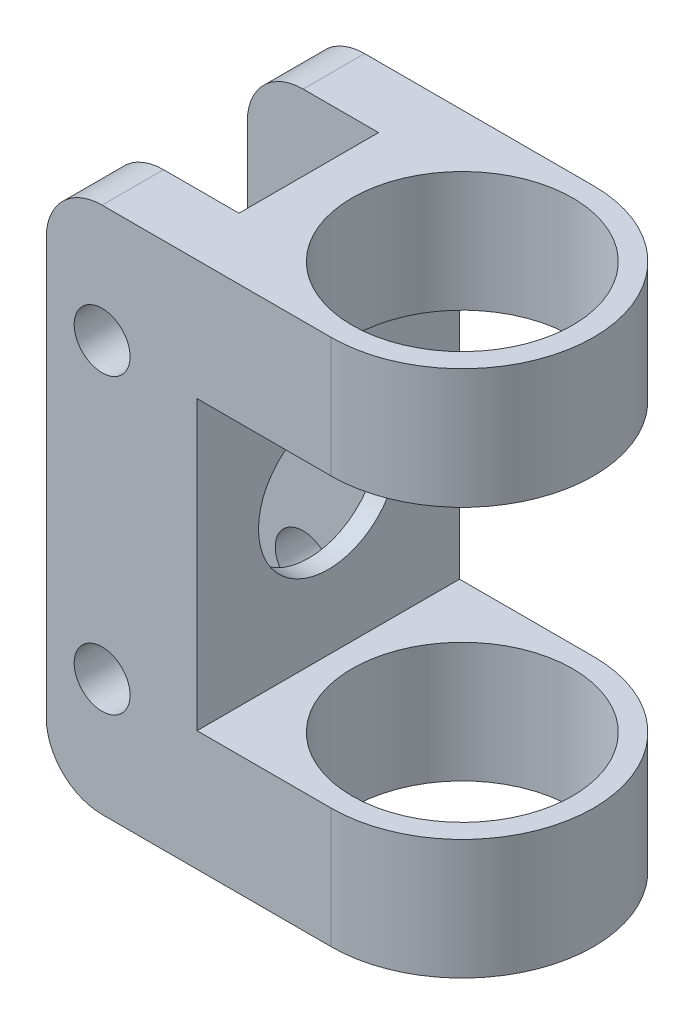
ISO-10303-21;
HEADER;
FILE_DESCRIPTION(('STEP AP214'),'2;1');
FILE_NAME('part.step','',(''),(''),'','','');
FILE_SCHEMA(('AUTOMOTIVE_DESIGN { 1 0 10303 214 1 1 1 1 }'));
ENDSEC;
DATA;
#1=APPLICATION_CONTEXT('core data for automotive mechanical design processes');
#2=APPLICATION_PROTOCOL_DEFINITION('international standard','automotive_design',2000,#1);
#3=PRODUCT_CONTEXT('',#1,'mechanical');
#4=PRODUCT('Part','Part','',(#3));
#5=PRODUCT_RELATED_PRODUCT_CATEGORY('part','',(#4));
#6=PRODUCT_DEFINITION_FORMATION('','',#4);
#7=PRODUCT_DEFINITION_CONTEXT('part definition',#1,'design');
#8=PRODUCT_DEFINITION('design','',#6,#7);
#9=PRODUCT_DEFINITION_SHAPE('','',#8);
#10=(LENGTH_UNIT() NAMED_UNIT(*) SI_UNIT(.MILLI.,.METRE.));
#11=(NAMED_UNIT(*) PLANE_ANGLE_UNIT() SI_UNIT($,.RADIAN.));
#12=(NAMED_UNIT(*) SI_UNIT($,.STERADIAN.) SOLID_ANGLE_UNIT());
#13=UNCERTAINTY_MEASURE_WITH_UNIT(LENGTH_MEASURE(1.E-05),#10,'distance_accuracy_value','');
#14=(GEOMETRIC_REPRESENTATION_CONTEXT(3) GLOBAL_UNCERTAINTY_ASSIGNED_CONTEXT((#13)) GLOBAL_UNIT_ASSIGNED_CONTEXT((#10,
#11,#12)) REPRESENTATION_CONTEXT('',''));
#15=CARTESIAN_POINT('',(0.,0.,0.));
#16=DIRECTION('',(0.,0.,1.));
#17=DIRECTION('',(1.,0.,0.));
#18=AXIS2_PLACEMENT_3D('',#15,#16,#17);
#19=CARTESIAN_POINT('',(-13.97,24.003,-6.35));
#20=DIRECTION('',(1.,0.,0.));
#21=DIRECTION('',(0.,0.,-1.));
#22=AXIS2_PLACEMENT_3D('',#19,#20,#21);
#23=PLANE('',#22);
#24=DIRECTION('',(0.,-1.,0.));
#25=VECTOR('',#24,1.);
#26=CARTESIAN_POINT('',(-13.97,24.003,-6.35));
#27=LINE('',#26,#25);
#28=CARTESIAN_POINT('',(-13.97,24.003,-6.35));
#29=VERTEX_POINT('',#28);
#30=CARTESIAN_POINT('',(-13.97,0.,-6.35));
#31=VERTEX_POINT('',#30);
#32=EDGE_CURVE('E174',#29,#31,#27,.T.);
#33=ORIENTED_EDGE('',*,*,#32,.T.);
#34=CARTESIAN_POINT('',(-13.97,0.,0.));
#35=DIRECTION('',(1.,0.,0.));
#36=DIRECTION('',(0.,0.,-1.));
#37=AXIS2_PLACEMENT_3D('',#34,#35,#36);
#38=CIRCLE('',#37,6.35);
#39=CARTESIAN_POINT('',(-13.97,0.,6.35));
#40=VERTEX_POINT('',#39);
#41=EDGE_CURVE('E158',#31,#40,#38,.T.);
#42=ORIENTED_EDGE('',*,*,#41,.T.);
#43=DIRECTION('',(0.,-1.,0.));
#44=VECTOR('',#43,1.);
#45=CARTESIAN_POINT('',(-13.97,24.003,6.35));
#46=LINE('',#45,#44);
#47=CARTESIAN_POINT('',(-13.97,24.003,6.35));
#48=VERTEX_POINT('',#47);
#49=EDGE_CURVE('E171',#48,#40,#46,.T.);
#50=ORIENTED_EDGE('',*,*,#49,.F.);
#51=DIRECTION('',(0.,0.,1.));
#52=VECTOR('',#51,1.);
#53=CARTESIAN_POINT('',(-13.97,24.003,-6.35));
#54=LINE('',#53,#52);
#55=EDGE_CURVE('E280',#29,#48,#54,.T.);
#56=ORIENTED_EDGE('',*,*,#55,.F.);
#57=EDGE_LOOP('',(#33,#42,#50,#56));
#58=FACE_BOUND('',#57,.T.);
#59=ADVANCED_FACE('F36',(#58),#23,.F.);
#60=CARTESIAN_POINT('',(0.,24.003,0.));
#61=DIRECTION('',(0.,-1.,0.));
#62=DIRECTION('',(0.,0.,-1.));
#63=AXIS2_PLACEMENT_3D('',#60,#61,#62);
#64=CYLINDRICAL_SURFACE('',#63,11.938);
#65=DIRECTION('',(0.,-1.,0.));
#66=VECTOR('',#65,1.);
#67=CARTESIAN_POINT('',(0.,24.003,-11.938));
#68=LINE('',#67,#66);
#69=CARTESIAN_POINT('',(0.,-13.081,-11.938));
#70=VERTEX_POINT('',#69);
#71=CARTESIAN_POINT('',(0.,-24.003,-11.938));
#72=VERTEX_POINT('',#71);
#73=EDGE_CURVE('E207',#70,#72,#68,.T.);
#74=ORIENTED_EDGE('',*,*,#73,.F.);
#75=CARTESIAN_POINT('',(0.,-13.081,0.));
#76=DIRECTION('',(0.,-1.,0.));
#77=DIRECTION('',(0.,0.,-1.));
#78=AXIS2_PLACEMENT_3D('',#75,#76,#77);
#79=CIRCLE('',#78,11.938);
#80=CARTESIAN_POINT('',(0.,-13.081,11.938));
#81=VERTEX_POINT('',#80);
#82=EDGE_CURVE('E223',#70,#81,#79,.T.);
#83=ORIENTED_EDGE('',*,*,#82,.T.);
#84=DIRECTION('',(0.,-1.,0.));
#85=VECTOR('',#84,1.);
#86=CARTESIAN_POINT('',(0.,24.003,11.938));
#87=LINE('',#86,#85);
#88=CARTESIAN_POINT('',(0.,-24.003,11.938));
#89=VERTEX_POINT('',#88);
#90=EDGE_CURVE('E297',#81,#89,#87,.T.);
#91=ORIENTED_EDGE('',*,*,#90,.T.);
#92=CARTESIAN_POINT('',(0.,-24.003,0.));
#93=DIRECTION('',(0.,1.,0.));
#94=DIRECTION('',(0.,0.,1.));
#95=AXIS2_PLACEMENT_3D('',#92,#93,#94);
#96=CIRCLE('',#95,11.938);
#97=EDGE_CURVE('E316',#89,#72,#96,.T.);
#98=ORIENTED_EDGE('',*,*,#97,.T.);
#99=EDGE_LOOP('',(#74,#83,#91,#98));
#100=FACE_BOUND('',#99,.T.);
#101=ADVANCED_FACE('F455',(#100),#64,.T.);
#102=CARTESIAN_POINT('',(0.,24.003,0.));
#103=DIRECTION('',(0.,-1.,0.));
#104=DIRECTION('',(0.,0.,-1.));
#105=AXIS2_PLACEMENT_3D('',#102,#103,#104);
#106=CYLINDRICAL_SURFACE('',#105,10.033);
#107=CARTESIAN_POINT('',(0.,-13.081,0.));
#108=DIRECTION('',(0.,-1.,0.));
#109=DIRECTION('',(0.,0.,-1.));
#110=AXIS2_PLACEMENT_3D('',#107,#108,#109);
#111=CIRCLE('',#110,10.033);
#112=CARTESIAN_POINT('',(0.,-13.081,-10.033));
#113=VERTEX_POINT('',#112);
#114=EDGE_CURVE('E219',#113,#113,#111,.T.);
#115=ORIENTED_EDGE('',*,*,#114,.F.);
#116=EDGE_LOOP('',(#115));
#117=FACE_BOUND('',#116,.T.);
#118=CARTESIAN_POINT('',(0.,-24.003,0.));
#119=DIRECTION('',(0.,1.,0.));
#120=DIRECTION('',(0.,0.,1.));
#121=AXIS2_PLACEMENT_3D('',#118,#119,#120);
#122=CIRCLE('',#121,10.033);
#123=CARTESIAN_POINT('',(0.,-24.003,10.033));
#124=VERTEX_POINT('',#123);
#125=EDGE_CURVE('E334',#124,#124,#122,.T.);
#126=ORIENTED_EDGE('',*,*,#125,.F.);
#127=EDGE_LOOP('',(#126));
#128=FACE_BOUND('',#127,.T.);
#129=ADVANCED_FACE('F510',(#117,#128),#106,.F.);
#130=CARTESIAN_POINT('',(0.,24.003,0.));
#131=DIRECTION('',(0.,1.,0.));
#132=DIRECTION('',(0.,0.,1.));
#133=AXIS2_PLACEMENT_3D('',#130,#131,#132);
#134=PLANE('',#133);
#135=DIRECTION('',(-1.,0.,0.));
#136=VECTOR('',#135,1.);
#137=CARTESIAN_POINT('',(0.,24.003,-11.938));
#138=LINE('',#137,#136);
#139=CARTESIAN_POINT('',(0.,24.003,-11.938));
#140=VERTEX_POINT('',#139);
#141=CARTESIAN_POINT('',(-20.828,24.003,-11.938));
#142=VERTEX_POINT('',#141);
#143=EDGE_CURVE('E328',#140,#142,#138,.T.);
#144=ORIENTED_EDGE('',*,*,#143,.T.);
#145=DIRECTION('',(0.,0.,1.));
#146=VECTOR('',#145,1.);
#147=CARTESIAN_POINT('',(-20.828,24.003,-6.35));
#148=LINE('',#147,#146);
#149=CARTESIAN_POINT('',(-20.828,24.003,-6.35));
#150=VERTEX_POINT('',#149);
#151=EDGE_CURVE('E230',#142,#150,#148,.T.);
#152=ORIENTED_EDGE('',*,*,#151,.T.);
#153=DIRECTION('',(1.,0.,0.));
#154=VECTOR('',#153,1.);
#155=CARTESIAN_POINT('',(-25.908,24.003,-6.35));
#156=LINE('',#155,#154);
#157=EDGE_CURVE('E325',#150,#29,#156,.T.);
#158=ORIENTED_EDGE('',*,*,#157,.T.);
#159=ORIENTED_EDGE('',*,*,#55,.T.);
#160=DIRECTION('',(-1.,0.,0.));
#161=VECTOR('',#160,1.);
#162=CARTESIAN_POINT('',(-13.97,24.003,6.35));
#163=LINE('',#162,#161);
#164=CARTESIAN_POINT('',(-20.828,24.003,6.35));
#165=VERTEX_POINT('',#164);
#166=EDGE_CURVE('E189',#48,#165,#163,.T.);
#167=ORIENTED_EDGE('',*,*,#166,.T.);
#168=DIRECTION('',(0.,0.,1.));
#169=VECTOR('',#168,1.);
#170=CARTESIAN_POINT('',(-20.828,24.003,11.938));
#171=LINE('',#170,#169);
#172=CARTESIAN_POINT('',(-20.828,24.003,11.938));
#173=VERTEX_POINT('',#172);
#174=EDGE_CURVE('E212',#165,#173,#171,.T.);
#175=ORIENTED_EDGE('',*,*,#174,.T.);
#176=DIRECTION('',(1.,0.,0.));
#177=VECTOR('',#176,1.);
#178=CARTESIAN_POINT('',(-25.908,24.003,11.938));
#179=LINE('',#178,#177);
#180=CARTESIAN_POINT('',(0.,24.003,11.938));
#181=VERTEX_POINT('',#180);
#182=EDGE_CURVE('E282',#173,#181,#179,.T.);
#183=ORIENTED_EDGE('',*,*,#182,.T.);
#184=CARTESIAN_POINT('',(0.,24.003,0.));
#185=DIRECTION('',(0.,1.,0.));
#186=DIRECTION('',(0.,0.,1.));
#187=AXIS2_PLACEMENT_3D('',#184,#185,#186);
#188=CIRCLE('',#187,11.938);
#189=EDGE_CURVE('E303',#181,#140,#188,.T.);
#190=ORIENTED_EDGE('',*,*,#189,.T.);
#191=EDGE_LOOP('',(#144,#152,#158,#159,#167,#175,#183,#190));
#192=FACE_BOUND('',#191,.T.);
#193=CARTESIAN_POINT('',(0.,24.003,0.));
#194=DIRECTION('',(0.,1.,0.));
#195=DIRECTION('',(0.,0.,1.));
#196=AXIS2_PLACEMENT_3D('',#193,#194,#195);
#197=CIRCLE('',#196,10.033);
#198=CARTESIAN_POINT('',(0.,24.003,10.033));
#199=VERTEX_POINT('',#198);
#200=EDGE_CURVE('E320',#199,#199,#197,.T.);
#201=ORIENTED_EDGE('',*,*,#200,.F.);
#202=EDGE_LOOP('',(#201));
#203=FACE_BOUND('',#202,.T.);
#204=ADVANCED_FACE('F277',(#192,#203),#134,.T.);
#205=CARTESIAN_POINT('',(0.,-24.003,0.));
#206=DIRECTION('',(0.,1.,0.));
#207=DIRECTION('',(0.,0.,1.));
#208=AXIS2_PLACEMENT_3D('',#205,#206,#207);
#209=PLANE('',#208);
#210=DIRECTION('',(1.,0.,0.));
#211=VECTOR('',#210,1.);
#212=CARTESIAN_POINT('',(-25.908,-24.003,-6.35));
#213=LINE('',#212,#211);
#214=CARTESIAN_POINT('',(-20.828,-24.003,-6.35));
#215=VERTEX_POINT('',#214);
#216=CARTESIAN_POINT('',(-13.97,-24.003,-6.35));
#217=VERTEX_POINT('',#216);
#218=EDGE_CURVE('E309',#215,#217,#213,.T.);
#219=ORIENTED_EDGE('',*,*,#218,.F.);
#220=DIRECTION('',(0.,0.,1.));
#221=VECTOR('',#220,1.);
#222=CARTESIAN_POINT('',(-20.828,-24.003,0.));
#223=LINE('',#222,#221);
#224=CARTESIAN_POINT('',(-20.828,-24.003,-11.938));
#225=VERTEX_POINT('',#224);
#226=EDGE_CURVE('E256',#215,#225,#223,.F.);
#227=ORIENTED_EDGE('',*,*,#226,.T.);
#228=DIRECTION('',(-1.,0.,0.));
#229=VECTOR('',#228,1.);
#230=CARTESIAN_POINT('',(0.,-24.003,-11.938));
#231=LINE('',#230,#229);
#232=EDGE_CURVE('E312',#72,#225,#231,.T.);
#233=ORIENTED_EDGE('',*,*,#232,.F.);
#234=ORIENTED_EDGE('',*,*,#97,.F.);
#235=DIRECTION('',(1.,0.,0.));
#236=VECTOR('',#235,1.);
#237=CARTESIAN_POINT('',(-25.908,-24.003,11.938));
#238=LINE('',#237,#236);
#239=CARTESIAN_POINT('',(-20.828,-24.003,11.938));
#240=VERTEX_POINT('',#239);
#241=EDGE_CURVE('E300',#240,#89,#238,.T.);
#242=ORIENTED_EDGE('',*,*,#241,.F.);
#243=DIRECTION('',(0.,0.,1.));
#244=VECTOR('',#243,1.);
#245=CARTESIAN_POINT('',(-20.828,-24.003,0.));
#246=LINE('',#245,#244);
#247=CARTESIAN_POINT('',(-20.828,-24.003,6.35));
#248=VERTEX_POINT('',#247);
#249=EDGE_CURVE('E253',#240,#248,#246,.F.);
#250=ORIENTED_EDGE('',*,*,#249,.T.);
#251=DIRECTION('',(-1.,0.,0.));
#252=VECTOR('',#251,1.);
#253=CARTESIAN_POINT('',(-13.97,-24.003,6.35));
#254=LINE('',#253,#252);
#255=CARTESIAN_POINT('',(-13.97,-24.003,6.35));
#256=VERTEX_POINT('',#255);
#257=EDGE_CURVE('E304',#256,#248,#254,.T.);
#258=ORIENTED_EDGE('',*,*,#257,.F.);
#259=DIRECTION('',(0.,0.,1.));
#260=VECTOR('',#259,1.);
#261=CARTESIAN_POINT('',(-13.97,-24.003,-6.35));
#262=LINE('',#261,#260);
#263=EDGE_CURVE('E181',#217,#256,#262,.T.);
#264=ORIENTED_EDGE('',*,*,#263,.F.);
#265=EDGE_LOOP('',(#219,#227,#233,#234,#242,#250,#258,#264));
#266=FACE_BOUND('',#265,.T.);
#267=ORIENTED_EDGE('',*,*,#125,.T.);
#268=EDGE_LOOP('',(#267));
#269=FACE_BOUND('',#268,.T.);
#270=ADVANCED_FACE('F446',(#266,#269),#209,.F.);
#271=CARTESIAN_POINT('',(0.,13.081,11.938));
#272=VERTEX_POINT('',#271);
#273=EDGE_CURVE('E292',#181,#272,#87,.T.);
#274=ORIENTED_EDGE('',*,*,#273,.T.);
#275=CARTESIAN_POINT('',(0.,13.081,0.));
#276=DIRECTION('',(0.,1.,0.));
#277=DIRECTION('',(-1.,0.,0.));
#278=AXIS2_PLACEMENT_3D('',#275,#276,#277);
#279=CIRCLE('',#278,11.938);
#280=CARTESIAN_POINT('',(0.,13.081,-11.938));
#281=VERTEX_POINT('',#280);
#282=EDGE_CURVE('E217',#272,#281,#279,.T.);
#283=ORIENTED_EDGE('',*,*,#282,.T.);
#284=EDGE_CURVE('E208',#140,#281,#68,.T.);
#285=ORIENTED_EDGE('',*,*,#284,.F.);
#286=ORIENTED_EDGE('',*,*,#189,.F.);
#287=EDGE_LOOP('',(#274,#283,#285,#286));
#288=FACE_BOUND('',#287,.T.);
#289=ADVANCED_FACE('F426',(#288),#64,.T.);
#290=CARTESIAN_POINT('',(0.,24.003,-11.938));
#291=DIRECTION('',(0.,0.,1.));
#292=DIRECTION('',(1.,0.,0.));
#293=AXIS2_PLACEMENT_3D('',#290,#291,#292);
#294=PLANE('',#293);
#295=CARTESIAN_POINT('',(-20.828,13.335,-11.938));
#296=DIRECTION('',(0.,0.,1.));
#297=DIRECTION('',(1.,0.,0.));
#298=AXIS2_PLACEMENT_3D('',#295,#296,#297);
#299=CIRCLE('',#298,2.54);
#300=CARTESIAN_POINT('',(-18.288,13.335,-11.938));
#301=VERTEX_POINT('',#300);
#302=EDGE_CURVE('E369',#301,#301,#299,.T.);
#303=ORIENTED_EDGE('',*,*,#302,.T.);
#304=EDGE_LOOP('',(#303));
#305=FACE_BOUND('',#304,.T.);
#306=CARTESIAN_POINT('',(-20.828,-13.335,-11.938));
#307=DIRECTION('',(0.,0.,1.));
#308=DIRECTION('',(1.,0.,0.));
#309=AXIS2_PLACEMENT_3D('',#306,#307,#308);
#310=CIRCLE('',#309,2.54);
#311=CARTESIAN_POINT('',(-18.288,-13.335,-11.938));
#312=VERTEX_POINT('',#311);
#313=EDGE_CURVE('E361',#312,#312,#310,.T.);
#314=ORIENTED_EDGE('',*,*,#313,.T.);
#315=EDGE_LOOP('',(#314));
#316=FACE_BOUND('',#315,.T.);
#317=DIRECTION('',(0.,-1.,0.));
#318=VECTOR('',#317,1.);
#319=CARTESIAN_POINT('',(-25.908,24.003,-11.938));
#320=LINE('',#319,#318);
#321=CARTESIAN_POINT('',(-25.908,18.923,-11.938));
#322=VERTEX_POINT('',#321);
#323=CARTESIAN_POINT('',(-25.908,-18.923,-11.938));
#324=VERTEX_POINT('',#323);
#325=EDGE_CURVE('E203',#322,#324,#320,.T.);
#326=ORIENTED_EDGE('',*,*,#325,.F.);
#327=CARTESIAN_POINT('',(-20.828,18.923,-11.938));
#328=DIRECTION('',(0.,0.,1.));
#329=DIRECTION('',(1.,0.,0.));
#330=AXIS2_PLACEMENT_3D('',#327,#328,#329);
#331=CIRCLE('',#330,5.08);
#332=EDGE_CURVE('E250',#322,#142,#331,.F.);
#333=ORIENTED_EDGE('',*,*,#332,.T.);
#334=ORIENTED_EDGE('',*,*,#143,.F.);
#335=ORIENTED_EDGE('',*,*,#284,.T.);
#336=DIRECTION('',(-1.,0.,0.));
#337=VECTOR('',#336,1.);
#338=CARTESIAN_POINT('',(-12.192,13.081,-11.938));
#339=LINE('',#338,#337);
#340=CARTESIAN_POINT('',(-12.192,13.081,-11.938));
#341=VERTEX_POINT('',#340);
#342=EDGE_CURVE('E391',#281,#341,#339,.T.);
#343=ORIENTED_EDGE('',*,*,#342,.T.);
#344=DIRECTION('',(0.,-1.,0.));
#345=VECTOR('',#344,1.);
#346=CARTESIAN_POINT('',(-12.192,-13.081,-11.938));
#347=LINE('',#346,#345);
#348=CARTESIAN_POINT('',(-12.192,-13.081,-11.938));
#349=VERTEX_POINT('',#348);
#350=EDGE_CURVE('E387',#341,#349,#347,.T.);
#351=ORIENTED_EDGE('',*,*,#350,.T.);
#352=DIRECTION('',(1.,0.,0.));
#353=VECTOR('',#352,1.);
#354=CARTESIAN_POINT('',(-12.192,-13.081,-11.938));
#355=LINE('',#354,#353);
#356=EDGE_CURVE('E381',#349,#70,#355,.T.);
#357=ORIENTED_EDGE('',*,*,#356,.T.);
#358=ORIENTED_EDGE('',*,*,#73,.T.);
#359=ORIENTED_EDGE('',*,*,#232,.T.);
#360=CARTESIAN_POINT('',(-20.828,-18.923,-11.938));
#361=DIRECTION('',(0.,0.,1.));
#362=DIRECTION('',(1.,0.,0.));
#363=AXIS2_PLACEMENT_3D('',#360,#361,#362);
#364=CIRCLE('',#363,5.08);
#365=EDGE_CURVE('E247',#225,#324,#364,.F.);
#366=ORIENTED_EDGE('',*,*,#365,.T.);
#367=EDGE_LOOP('',(#326,#333,#334,#335,#343,#351,#357,#358,#359,#366));
#368=FACE_BOUND('',#367,.T.);
#369=ADVANCED_FACE('F422',(#305,#316,#368),#294,.F.);
#370=CARTESIAN_POINT('',(-25.908,24.003,-11.938));
#371=DIRECTION('',(1.,0.,0.));
#372=DIRECTION('',(0.,0.,-1.));
#373=AXIS2_PLACEMENT_3D('',#370,#371,#372);
#374=PLANE('',#373);
#375=DIRECTION('',(0.,-1.,0.));
#376=VECTOR('',#375,1.);
#377=CARTESIAN_POINT('',(-25.908,24.003,-6.35));
#378=LINE('',#377,#376);
#379=CARTESIAN_POINT('',(-25.908,18.923,-6.35));
#380=VERTEX_POINT('',#379);
#381=CARTESIAN_POINT('',(-25.908,-18.923,-6.35));
#382=VERTEX_POINT('',#381);
#383=EDGE_CURVE('E199',#380,#382,#378,.T.);
#384=ORIENTED_EDGE('',*,*,#383,.F.);
#385=DIRECTION('',(0.,0.,1.));
#386=VECTOR('',#385,1.);
#387=CARTESIAN_POINT('',(-25.908,18.923,-11.938));
#388=LINE('',#387,#386);
#389=EDGE_CURVE('E244',#380,#322,#388,.F.);
#390=ORIENTED_EDGE('',*,*,#389,.T.);
#391=ORIENTED_EDGE('',*,*,#325,.T.);
#392=DIRECTION('',(0.,0.,1.));
#393=VECTOR('',#392,1.);
#394=CARTESIAN_POINT('',(-25.908,-18.923,-11.938));
#395=LINE('',#394,#393);
#396=EDGE_CURVE('E240',#324,#382,#395,.T.);
#397=ORIENTED_EDGE('',*,*,#396,.T.);
#398=EDGE_LOOP('',(#384,#390,#391,#397));
#399=FACE_BOUND('',#398,.T.);
#400=ADVANCED_FACE('F438',(#399),#374,.F.);
#401=CARTESIAN_POINT('',(-25.908,24.003,-6.35));
#402=DIRECTION('',(0.,0.,-1.));
#403=DIRECTION('',(-1.,0.,0.));
#404=AXIS2_PLACEMENT_3D('',#401,#402,#403);
#405=PLANE('',#404);
#406=CARTESIAN_POINT('',(-20.828,13.335,-6.35));
#407=DIRECTION('',(0.,0.,-1.));
#408=DIRECTION('',(-1.,0.,0.));
#409=AXIS2_PLACEMENT_3D('',#406,#407,#408);
#410=CIRCLE('',#409,2.54);
#411=CARTESIAN_POINT('',(-23.368,13.335,-6.35));
#412=VERTEX_POINT('',#411);
#413=EDGE_CURVE('E338',#412,#412,#410,.T.);
#414=ORIENTED_EDGE('',*,*,#413,.T.);
#415=EDGE_LOOP('',(#414));
#416=FACE_BOUND('',#415,.T.);
#417=ORIENTED_EDGE('',*,*,#157,.F.);
#418=CARTESIAN_POINT('',(-20.828,18.923,-6.35));
#419=DIRECTION('',(0.,0.,-1.));
#420=DIRECTION('',(-1.,0.,0.));
#421=AXIS2_PLACEMENT_3D('',#418,#419,#420);
#422=CIRCLE('',#421,5.08);
#423=EDGE_CURVE('E237',#150,#380,#422,.F.);
#424=ORIENTED_EDGE('',*,*,#423,.T.);
#425=ORIENTED_EDGE('',*,*,#383,.T.);
#426=CARTESIAN_POINT('',(-20.828,-18.923,-6.35));
#427=DIRECTION('',(0.,0.,-1.));
#428=DIRECTION('',(-1.,0.,0.));
#429=AXIS2_PLACEMENT_3D('',#426,#427,#428);
#430=CIRCLE('',#429,5.08);
#431=EDGE_CURVE('E234',#382,#215,#430,.F.);
#432=ORIENTED_EDGE('',*,*,#431,.T.);
#433=ORIENTED_EDGE('',*,*,#218,.T.);
#434=EDGE_CURVE('E191',#31,#217,#27,.T.);
#435=ORIENTED_EDGE('',*,*,#434,.F.);
#436=ORIENTED_EDGE('',*,*,#32,.F.);
#437=EDGE_LOOP('',(#417,#424,#425,#432,#433,#435,#436));
#438=FACE_BOUND('',#437,.T.);
#439=CARTESIAN_POINT('',(-20.828,-13.335,-6.35));
#440=DIRECTION('',(0.,0.,-1.));
#441=DIRECTION('',(-1.,0.,0.));
#442=AXIS2_PLACEMENT_3D('',#439,#440,#441);
#443=CIRCLE('',#442,2.54);
#444=CARTESIAN_POINT('',(-23.368,-13.335,-6.35));
#445=VERTEX_POINT('',#444);
#446=EDGE_CURVE('E349',#445,#445,#443,.T.);
#447=ORIENTED_EDGE('',*,*,#446,.T.);
#448=EDGE_LOOP('',(#447));
#449=FACE_BOUND('',#448,.T.);
#450=ADVANCED_FACE('F435',(#416,#438,#449),#405,.F.);
#451=EDGE_CURVE('E178',#40,#256,#46,.T.);
#452=ORIENTED_EDGE('',*,*,#451,.F.);
#453=EDGE_CURVE('E155',#40,#31,#38,.T.);
#454=ORIENTED_EDGE('',*,*,#453,.T.);
#455=ORIENTED_EDGE('',*,*,#434,.T.);
#456=ORIENTED_EDGE('',*,*,#263,.T.);
#457=EDGE_LOOP('',(#452,#454,#455,#456));
#458=FACE_BOUND('',#457,.T.);
#459=ADVANCED_FACE('F179',(#458),#23,.F.);
#460=CARTESIAN_POINT('',(-13.97,24.003,6.35));
#461=DIRECTION('',(0.,0.,1.));
#462=DIRECTION('',(1.,0.,0.));
#463=AXIS2_PLACEMENT_3D('',#460,#461,#462);
#464=PLANE('',#463);
#465=CARTESIAN_POINT('',(-20.828,-13.335,6.35));
#466=DIRECTION('',(0.,0.,1.));
#467=DIRECTION('',(1.,0.,0.));
#468=AXIS2_PLACEMENT_3D('',#465,#466,#467);
#469=CIRCLE('',#468,2.54);
#470=CARTESIAN_POINT('',(-18.288,-13.335,6.35));
#471=VERTEX_POINT('',#470);
#472=EDGE_CURVE('E353',#471,#471,#469,.T.);
#473=ORIENTED_EDGE('',*,*,#472,.T.);
#474=EDGE_LOOP('',(#473));
#475=FACE_BOUND('',#474,.T.);
#476=ORIENTED_EDGE('',*,*,#257,.T.);
#477=CARTESIAN_POINT('',(-20.828,-18.923,6.35));
#478=DIRECTION('',(0.,0.,1.));
#479=DIRECTION('',(1.,0.,0.));
#480=AXIS2_PLACEMENT_3D('',#477,#478,#479);
#481=CIRCLE('',#480,5.08);
#482=CARTESIAN_POINT('',(-25.908,-18.923,6.35));
#483=VERTEX_POINT('',#482);
#484=EDGE_CURVE('E11',#248,#483,#481,.F.);
#485=ORIENTED_EDGE('',*,*,#484,.T.);
#486=DIRECTION('',(0.,-1.,0.));
#487=VECTOR('',#486,1.);
#488=CARTESIAN_POINT('',(-25.908,24.003,6.35));
#489=LINE('',#488,#487);
#490=CARTESIAN_POINT('',(-25.908,18.923,6.35));
#491=VERTEX_POINT('',#490);
#492=EDGE_CURVE('E184',#491,#483,#489,.T.);
#493=ORIENTED_EDGE('',*,*,#492,.F.);
#494=CARTESIAN_POINT('',(-20.828,18.923,6.35));
#495=DIRECTION('',(0.,0.,1.));
#496=DIRECTION('',(1.,0.,0.));
#497=AXIS2_PLACEMENT_3D('',#494,#495,#496);
#498=CIRCLE('',#497,5.08);
#499=EDGE_CURVE('E45',#491,#165,#498,.F.);
#500=ORIENTED_EDGE('',*,*,#499,.T.);
#501=ORIENTED_EDGE('',*,*,#166,.F.);
#502=ORIENTED_EDGE('',*,*,#49,.T.);
#503=ORIENTED_EDGE('',*,*,#451,.T.);
#504=EDGE_LOOP('',(#476,#485,#493,#500,#501,#502,#503));
#505=FACE_BOUND('',#504,.T.);
#506=CARTESIAN_POINT('',(-20.828,13.335,6.35));
#507=DIRECTION('',(0.,0.,1.));
#508=DIRECTION('',(1.,0.,0.));
#509=AXIS2_PLACEMENT_3D('',#506,#507,#508);
#510=CIRCLE('',#509,2.54);
#511=CARTESIAN_POINT('',(-18.288,13.335,6.35));
#512=VERTEX_POINT('',#511);
#513=EDGE_CURVE('E345',#512,#512,#510,.T.);
#514=ORIENTED_EDGE('',*,*,#513,.T.);
#515=EDGE_LOOP('',(#514));
#516=FACE_BOUND('',#515,.T.);
#517=ADVANCED_FACE('F186',(#475,#505,#516),#464,.F.);
#518=CARTESIAN_POINT('',(-25.908,24.003,6.35));
#519=DIRECTION('',(1.,0.,0.));
#520=DIRECTION('',(0.,0.,-1.));
#521=AXIS2_PLACEMENT_3D('',#518,#519,#520);
#522=PLANE('',#521);
#523=ORIENTED_EDGE('',*,*,#492,.T.);
#524=DIRECTION('',(0.,0.,1.));
#525=VECTOR('',#524,1.);
#526=CARTESIAN_POINT('',(-25.908,-18.923,6.35));
#527=LINE('',#526,#525);
#528=CARTESIAN_POINT('',(-25.908,-18.923,11.938));
#529=VERTEX_POINT('',#528);
#530=EDGE_CURVE('E261',#483,#529,#527,.T.);
#531=ORIENTED_EDGE('',*,*,#530,.T.);
#532=DIRECTION('',(0.,-1.,0.));
#533=VECTOR('',#532,1.);
#534=CARTESIAN_POINT('',(-25.908,24.003,11.938));
#535=LINE('',#534,#533);
#536=CARTESIAN_POINT('',(-25.908,18.923,11.938));
#537=VERTEX_POINT('',#536);
#538=EDGE_CURVE('E287',#537,#529,#535,.T.);
#539=ORIENTED_EDGE('',*,*,#538,.F.);
#540=DIRECTION('',(0.,0.,1.));
#541=VECTOR('',#540,1.);
#542=CARTESIAN_POINT('',(-25.908,18.923,6.35));
#543=LINE('',#542,#541);
#544=EDGE_CURVE('E57',#537,#491,#543,.F.);
#545=ORIENTED_EDGE('',*,*,#544,.T.);
#546=EDGE_LOOP('',(#523,#531,#539,#545));
#547=FACE_BOUND('',#546,.T.);
#548=ADVANCED_FACE('F289',(#547),#522,.F.);
#549=CARTESIAN_POINT('',(-25.908,24.003,11.938));
#550=DIRECTION('',(0.,0.,-1.));
#551=DIRECTION('',(-1.,0.,0.));
#552=AXIS2_PLACEMENT_3D('',#549,#550,#551);
#553=PLANE('',#552);
#554=CARTESIAN_POINT('',(-20.828,13.335,11.938));
#555=DIRECTION('',(0.,0.,1.));
#556=DIRECTION('',(1.,0.,0.));
#557=AXIS2_PLACEMENT_3D('',#554,#555,#556);
#558=CIRCLE('',#557,2.54);
#559=CARTESIAN_POINT('',(-18.288,13.335,11.938));
#560=VERTEX_POINT('',#559);
#561=EDGE_CURVE('E365',#560,#560,#558,.T.);
#562=ORIENTED_EDGE('',*,*,#561,.F.);
#563=EDGE_LOOP('',(#562));
#564=FACE_BOUND('',#563,.T.);
#565=CARTESIAN_POINT('',(-20.828,-13.335,11.938));
#566=DIRECTION('',(0.,0.,1.));
#567=DIRECTION('',(1.,0.,0.));
#568=AXIS2_PLACEMENT_3D('',#565,#566,#567);
#569=CIRCLE('',#568,2.54);
#570=CARTESIAN_POINT('',(-18.288,-13.335,11.938));
#571=VERTEX_POINT('',#570);
#572=EDGE_CURVE('E176',#571,#571,#569,.T.);
#573=ORIENTED_EDGE('',*,*,#572,.F.);
#574=EDGE_LOOP('',(#573));
#575=FACE_BOUND('',#574,.T.);
#576=ORIENTED_EDGE('',*,*,#538,.T.);
#577=CARTESIAN_POINT('',(-20.828,-18.923,11.938));
#578=DIRECTION('',(0.,0.,-1.));
#579=DIRECTION('',(-1.,0.,0.));
#580=AXIS2_PLACEMENT_3D('',#577,#578,#579);
#581=CIRCLE('',#580,5.08);
#582=EDGE_CURVE('E268',#529,#240,#581,.F.);
#583=ORIENTED_EDGE('',*,*,#582,.T.);
#584=ORIENTED_EDGE('',*,*,#241,.T.);
#585=ORIENTED_EDGE('',*,*,#90,.F.);
#586=DIRECTION('',(1.,0.,0.));
#587=VECTOR('',#586,1.);
#588=CARTESIAN_POINT('',(-12.192,-13.081,11.938));
#589=LINE('',#588,#587);
#590=CARTESIAN_POINT('',(-12.192,-13.081,11.938));
#591=VERTEX_POINT('',#590);
#592=EDGE_CURVE('E395',#591,#81,#589,.T.);
#593=ORIENTED_EDGE('',*,*,#592,.F.);
#594=DIRECTION('',(0.,-1.,0.));
#595=VECTOR('',#594,1.);
#596=CARTESIAN_POINT('',(-12.192,-13.081,11.938));
#597=LINE('',#596,#595);
#598=CARTESIAN_POINT('',(-12.192,13.081,11.938));
#599=VERTEX_POINT('',#598);
#600=EDGE_CURVE('E399',#599,#591,#597,.T.);
#601=ORIENTED_EDGE('',*,*,#600,.F.);
#602=DIRECTION('',(-1.,0.,0.));
#603=VECTOR('',#602,1.);
#604=CARTESIAN_POINT('',(-12.192,13.081,11.938));
#605=LINE('',#604,#603);
#606=EDGE_CURVE('E373',#272,#599,#605,.T.);
#607=ORIENTED_EDGE('',*,*,#606,.F.);
#608=ORIENTED_EDGE('',*,*,#273,.F.);
#609=ORIENTED_EDGE('',*,*,#182,.F.);
#610=CARTESIAN_POINT('',(-20.828,18.923,11.938));
#611=DIRECTION('',(0.,0.,-1.));
#612=DIRECTION('',(-1.,0.,0.));
#613=AXIS2_PLACEMENT_3D('',#610,#611,#612);
#614=CIRCLE('',#613,5.08);
#615=EDGE_CURVE('E265',#173,#537,#614,.F.);
#616=ORIENTED_EDGE('',*,*,#615,.T.);
#617=EDGE_LOOP('',(#576,#583,#584,#585,#593,#601,#607,#608,#609,#616));
#618=FACE_BOUND('',#617,.T.);
#619=ADVANCED_FACE('F286',(#564,#575,#618),#553,.F.);
#620=CARTESIAN_POINT('',(0.,13.081,0.));
#621=DIRECTION('',(0.,1.,0.));
#622=DIRECTION('',(-1.,0.,0.));
#623=AXIS2_PLACEMENT_3D('',#620,#621,#622);
#624=CIRCLE('',#623,10.033);
#625=CARTESIAN_POINT('',(-10.033,13.081,0.));
#626=VERTEX_POINT('',#625);
#627=EDGE_CURVE('E213',#626,#626,#624,.T.);
#628=ORIENTED_EDGE('',*,*,#627,.F.);
#629=EDGE_LOOP('',(#628));
#630=FACE_BOUND('',#629,.T.);
#631=ORIENTED_EDGE('',*,*,#200,.T.);
#632=EDGE_LOOP('',(#631));
#633=FACE_BOUND('',#632,.T.);
#634=ADVANCED_FACE('F518',(#630,#633),#106,.F.);
#635=CARTESIAN_POINT('',(-12.192,-13.081,-11.938));
#636=DIRECTION('',(0.,-1.,0.));
#637=DIRECTION('',(0.,0.,-1.));
#638=AXIS2_PLACEMENT_3D('',#635,#636,#637);
#639=PLANE('',#638);
#640=ORIENTED_EDGE('',*,*,#114,.T.);
#641=EDGE_LOOP('',(#640));
#642=FACE_BOUND('',#641,.T.);
#643=ORIENTED_EDGE('',*,*,#356,.F.);
#644=DIRECTION('',(0.,0.,1.));
#645=VECTOR('',#644,1.);
#646=CARTESIAN_POINT('',(-12.192,-13.081,-11.938));
#647=LINE('',#646,#645);
#648=EDGE_CURVE('E218',#349,#591,#647,.T.);
#649=ORIENTED_EDGE('',*,*,#648,.T.);
#650=ORIENTED_EDGE('',*,*,#592,.T.);
#651=ORIENTED_EDGE('',*,*,#82,.F.);
#652=EDGE_LOOP('',(#643,#649,#650,#651));
#653=FACE_BOUND('',#652,.T.);
#654=ADVANCED_FACE('F418',(#642,#653),#639,.F.);
#655=CARTESIAN_POINT('',(-12.192,13.081,-11.938));
#656=DIRECTION('',(0.,1.,0.));
#657=DIRECTION('',(-1.,0.,0.));
#658=AXIS2_PLACEMENT_3D('',#655,#656,#657);
#659=PLANE('',#658);
#660=ORIENTED_EDGE('',*,*,#627,.T.);
#661=EDGE_LOOP('',(#660));
#662=FACE_BOUND('',#661,.T.);
#663=ORIENTED_EDGE('',*,*,#606,.T.);
#664=DIRECTION('',(0.,0.,1.));
#665=VECTOR('',#664,1.);
#666=CARTESIAN_POINT('',(-12.192,13.081,-11.938));
#667=LINE('',#666,#665);
#668=EDGE_CURVE('E377',#341,#599,#667,.T.);
#669=ORIENTED_EDGE('',*,*,#668,.F.);
#670=ORIENTED_EDGE('',*,*,#342,.F.);
#671=ORIENTED_EDGE('',*,*,#282,.F.);
#672=EDGE_LOOP('',(#663,#669,#670,#671));
#673=FACE_BOUND('',#672,.T.);
#674=ADVANCED_FACE('F407',(#662,#673),#659,.F.);
#675=CARTESIAN_POINT('',(-12.192,-13.081,-11.938));
#676=DIRECTION('',(-1.,0.,0.));
#677=DIRECTION('',(0.,0.,1.));
#678=AXIS2_PLACEMENT_3D('',#675,#676,#677);
#679=PLANE('',#678);
#680=CARTESIAN_POINT('',(-12.192,0.,0.));
#681=DIRECTION('',(-1.,0.,0.));
#682=DIRECTION('',(0.,0.,1.));
#683=AXIS2_PLACEMENT_3D('',#680,#681,#682);
#684=CIRCLE('',#683,6.35);
#685=CARTESIAN_POINT('',(-12.192,0.,6.35));
#686=VERTEX_POINT('',#685);
#687=EDGE_CURVE('E164',#686,#686,#684,.T.);
#688=ORIENTED_EDGE('',*,*,#687,.T.);
#689=EDGE_LOOP('',(#688));
#690=FACE_BOUND('',#689,.T.);
#691=ORIENTED_EDGE('',*,*,#648,.F.);
#692=ORIENTED_EDGE('',*,*,#350,.F.);
#693=ORIENTED_EDGE('',*,*,#668,.T.);
#694=ORIENTED_EDGE('',*,*,#600,.T.);
#695=EDGE_LOOP('',(#691,#692,#693,#694));
#696=FACE_BOUND('',#695,.T.);
#697=ADVANCED_FACE('F412',(#690,#696),#679,.F.);
#698=CARTESIAN_POINT('',(-20.828,-13.335,-11.938));
#699=DIRECTION('',(0.,0.,1.));
#700=DIRECTION('',(1.,0.,0.));
#701=AXIS2_PLACEMENT_3D('',#698,#699,#700);
#702=CYLINDRICAL_SURFACE('',#701,2.54);
#703=ORIENTED_EDGE('',*,*,#572,.T.);
#704=EDGE_LOOP('',(#703));
#705=FACE_BOUND('',#704,.T.);
#706=ORIENTED_EDGE('',*,*,#472,.F.);
#707=EDGE_LOOP('',(#706));
#708=FACE_BOUND('',#707,.T.);
#709=ADVANCED_FACE('F597',(#705,#708),#702,.F.);
#710=CARTESIAN_POINT('',(-20.828,13.335,-11.938));
#711=DIRECTION('',(0.,0.,1.));
#712=DIRECTION('',(1.,0.,0.));
#713=AXIS2_PLACEMENT_3D('',#710,#711,#712);
#714=CYLINDRICAL_SURFACE('',#713,2.54);
#715=ORIENTED_EDGE('',*,*,#561,.T.);
#716=EDGE_LOOP('',(#715));
#717=FACE_BOUND('',#716,.T.);
#718=ORIENTED_EDGE('',*,*,#513,.F.);
#719=EDGE_LOOP('',(#718));
#720=FACE_BOUND('',#719,.T.);
#721=ADVANCED_FACE('F605',(#717,#720),#714,.F.);
#722=ORIENTED_EDGE('',*,*,#313,.F.);
#723=EDGE_LOOP('',(#722));
#724=FACE_BOUND('',#723,.T.);
#725=ORIENTED_EDGE('',*,*,#446,.F.);
#726=EDGE_LOOP('',(#725));
#727=FACE_BOUND('',#726,.T.);
#728=ADVANCED_FACE('F608',(#724,#727),#702,.F.);
#729=ORIENTED_EDGE('',*,*,#302,.F.);
#730=EDGE_LOOP('',(#729));
#731=FACE_BOUND('',#730,.T.);
#732=ORIENTED_EDGE('',*,*,#413,.F.);
#733=EDGE_LOOP('',(#732));
#734=FACE_BOUND('',#733,.T.);
#735=ADVANCED_FACE('F616',(#731,#734),#714,.F.);
#736=CARTESIAN_POINT('',(-25.908,0.,0.));
#737=DIRECTION('',(1.,0.,0.));
#738=DIRECTION('',(0.,0.,-1.));
#739=AXIS2_PLACEMENT_3D('',#736,#737,#738);
#740=CYLINDRICAL_SURFACE('',#739,6.35);
#741=ORIENTED_EDGE('',*,*,#687,.F.);
#742=EDGE_LOOP('',(#741));
#743=FACE_BOUND('',#742,.T.);
#744=ORIENTED_EDGE('',*,*,#453,.F.);
#745=ORIENTED_EDGE('',*,*,#41,.F.);
#746=EDGE_LOOP('',(#744,#745));
#747=FACE_BOUND('',#746,.T.);
#748=ADVANCED_FACE('F157',(#743,#747),#740,.F.);
#749=CARTESIAN_POINT('',(-20.828,18.923,0.));
#750=DIRECTION('',(0.,0.,-1.));
#751=DIRECTION('',(-1.,0.,0.));
#752=AXIS2_PLACEMENT_3D('',#749,#750,#751);
#753=CYLINDRICAL_SURFACE('',#752,5.08);
#754=ORIENTED_EDGE('',*,*,#332,.F.);
#755=ORIENTED_EDGE('',*,*,#389,.F.);
#756=ORIENTED_EDGE('',*,*,#423,.F.);
#757=ORIENTED_EDGE('',*,*,#151,.F.);
#758=EDGE_LOOP('',(#754,#755,#756,#757));
#759=FACE_BOUND('',#758,.T.);
#760=ADVANCED_FACE('F431',(#759),#753,.T.);
#761=CARTESIAN_POINT('',(-20.828,-18.923,-11.938));
#762=DIRECTION('',(0.,0.,1.));
#763=DIRECTION('',(1.,0.,0.));
#764=AXIS2_PLACEMENT_3D('',#761,#762,#763);
#765=CYLINDRICAL_SURFACE('',#764,5.08);
#766=ORIENTED_EDGE('',*,*,#365,.F.);
#767=ORIENTED_EDGE('',*,*,#226,.F.);
#768=ORIENTED_EDGE('',*,*,#431,.F.);
#769=ORIENTED_EDGE('',*,*,#396,.F.);
#770=EDGE_LOOP('',(#766,#767,#768,#769));
#771=FACE_BOUND('',#770,.T.);
#772=ADVANCED_FACE('F442',(#771),#765,.T.);
#773=CARTESIAN_POINT('',(-20.828,-18.923,6.35));
#774=DIRECTION('',(0.,0.,1.));
#775=DIRECTION('',(1.,0.,0.));
#776=AXIS2_PLACEMENT_3D('',#773,#774,#775);
#777=CYLINDRICAL_SURFACE('',#776,5.08);
#778=ORIENTED_EDGE('',*,*,#484,.F.);
#779=ORIENTED_EDGE('',*,*,#249,.F.);
#780=ORIENTED_EDGE('',*,*,#582,.F.);
#781=ORIENTED_EDGE('',*,*,#530,.F.);
#782=EDGE_LOOP('',(#778,#779,#780,#781));
#783=FACE_BOUND('',#782,.T.);
#784=ADVANCED_FACE('F452',(#783),#777,.T.);
#785=CARTESIAN_POINT('',(-20.828,18.923,0.));
#786=DIRECTION('',(0.,0.,-1.));
#787=DIRECTION('',(-1.,0.,0.));
#788=AXIS2_PLACEMENT_3D('',#785,#786,#787);
#789=CYLINDRICAL_SURFACE('',#788,5.08);
#790=ORIENTED_EDGE('',*,*,#499,.F.);
#791=ORIENTED_EDGE('',*,*,#544,.F.);
#792=ORIENTED_EDGE('',*,*,#615,.F.);
#793=ORIENTED_EDGE('',*,*,#174,.F.);
#794=EDGE_LOOP('',(#790,#791,#792,#793));
#795=FACE_BOUND('',#794,.T.);
#796=ADVANCED_FACE('F38',(#795),#789,.T.);
#797=CLOSED_SHELL('',(#59,#101,#129,#204,#270,#289,#369,#400,#450,#459,#517,#548,#619,#634,#654,
#674,#697,#709,#721,#728,#735,#748,#760,#772,#784,#796));
#798=MANIFOLD_SOLID_BREP('B2',#797);
#799=ADVANCED_BREP_SHAPE_REPRESENTATION('',(#18,#798),#14);
#800=SHAPE_DEFINITION_REPRESENTATION(#9,#799);
ENDSEC;
END-ISO-10303-21;
